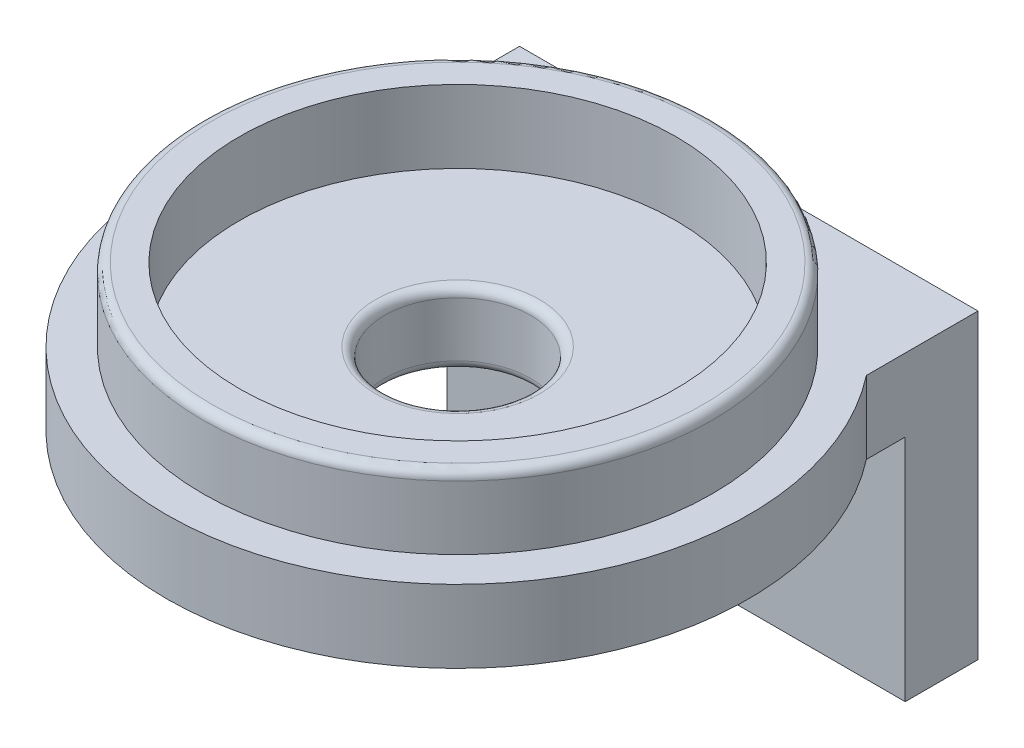
ISO-10303-21;
HEADER;
FILE_DESCRIPTION(('STEP AP214'),'2;1');
FILE_NAME('part.step','',(''),(''),'','','');
FILE_SCHEMA(('AUTOMOTIVE_DESIGN { 1 0 10303 214 1 1 1 1 }'));
ENDSEC;
DATA;
#1=APPLICATION_CONTEXT('core data for automotive mechanical design processes');
#2=APPLICATION_PROTOCOL_DEFINITION('international standard','automotive_design',2000,#1);
#3=PRODUCT_CONTEXT('',#1,'mechanical');
#4=PRODUCT('Part','Part','',(#3));
#5=PRODUCT_RELATED_PRODUCT_CATEGORY('part','',(#4));
#6=PRODUCT_DEFINITION_FORMATION('','',#4);
#7=PRODUCT_DEFINITION_CONTEXT('part definition',#1,'design');
#8=PRODUCT_DEFINITION('design','',#6,#7);
#9=PRODUCT_DEFINITION_SHAPE('','',#8);
#10=(LENGTH_UNIT() NAMED_UNIT(*) SI_UNIT(.MILLI.,.METRE.));
#11=(NAMED_UNIT(*) PLANE_ANGLE_UNIT() SI_UNIT($,.RADIAN.));
#12=(NAMED_UNIT(*) SI_UNIT($,.STERADIAN.) SOLID_ANGLE_UNIT());
#13=UNCERTAINTY_MEASURE_WITH_UNIT(LENGTH_MEASURE(1.E-05),#10,'distance_accuracy_value','');
#14=(GEOMETRIC_REPRESENTATION_CONTEXT(3) GLOBAL_UNCERTAINTY_ASSIGNED_CONTEXT((#13)) GLOBAL_UNIT_ASSIGNED_CONTEXT((#10,
#11,#12)) REPRESENTATION_CONTEXT('',''));
#15=CARTESIAN_POINT('',(0.,0.,0.));
#16=DIRECTION('',(0.,0.,1.));
#17=DIRECTION('',(1.,0.,0.));
#18=AXIS2_PLACEMENT_3D('',#15,#16,#17);
#19=CARTESIAN_POINT('',(0.,-32.3252119356495,0.));
#20=DIRECTION('',(0.,-1.,0.));
#21=DIRECTION('',(0.,0.,-1.));
#22=AXIS2_PLACEMENT_3D('',#19,#20,#21);
#23=CYLINDRICAL_SURFACE('',#22,25.4);
#24=CARTESIAN_POINT('',(0.,-3.175,0.));
#25=DIRECTION('',(0.,-1.,0.));
#26=DIRECTION('',(0.,0.,-1.));
#27=AXIS2_PLACEMENT_3D('',#24,#25,#26);
#28=CIRCLE('',#27,25.4);
#29=CARTESIAN_POINT('',(20.,-3.175,-15.6575860208399));
#30=VERTEX_POINT('',#29);
#31=CARTESIAN_POINT('',(-20.,-3.175,-15.6575860208399));
#32=VERTEX_POINT('',#31);
#33=EDGE_CURVE('E143',#30,#32,#28,.T.);
#34=ORIENTED_EDGE('',*,*,#33,.F.);
#35=DIRECTION('',(0.,-1.,0.));
#36=VECTOR('',#35,1.);
#37=CARTESIAN_POINT('',(20.,-32.3252119356495,-15.6575860208399));
#38=LINE('',#37,#36);
#39=CARTESIAN_POINT('',(20.,3.175,-15.6575860208399));
#40=VERTEX_POINT('',#39);
#41=EDGE_CURVE('E49',#30,#40,#38,.F.);
#42=ORIENTED_EDGE('',*,*,#41,.T.);
#43=CARTESIAN_POINT('',(0.,3.175,0.));
#44=DIRECTION('',(0.,-1.,0.));
#45=DIRECTION('',(0.,0.,-1.));
#46=AXIS2_PLACEMENT_3D('',#43,#44,#45);
#47=CIRCLE('',#46,25.4);
#48=CARTESIAN_POINT('',(-20.,3.175,-15.6575860208399));
#49=VERTEX_POINT('',#48);
#50=EDGE_CURVE('E106',#40,#49,#47,.T.);
#51=ORIENTED_EDGE('',*,*,#50,.T.);
#52=DIRECTION('',(0.,-1.,0.));
#53=VECTOR('',#52,1.);
#54=CARTESIAN_POINT('',(-20.,-32.3252119356495,-15.6575860208399));
#55=LINE('',#54,#53);
#56=EDGE_CURVE('E99',#32,#49,#55,.F.);
#57=ORIENTED_EDGE('',*,*,#56,.F.);
#58=EDGE_LOOP('',(#34,#42,#51,#57));
#59=FACE_BOUND('',#58,.T.);
#60=ADVANCED_FACE('F34',(#59),#23,.T.);
#61=CARTESIAN_POINT('',(0.,-3.175,-6.35));
#62=DIRECTION('',(0.,-1.,0.));
#63=DIRECTION('',(0.,0.,-1.));
#64=AXIS2_PLACEMENT_3D('',#61,#62,#63);
#65=PLANE('',#64);
#66=DIRECTION('',(1.,0.,0.));
#67=VECTOR('',#66,1.);
#68=CARTESIAN_POINT('',(0.,-3.175,-19.05));
#69=LINE('',#68,#67);
#70=CARTESIAN_POINT('',(-20.,-3.175,-19.05));
#71=VERTEX_POINT('',#70);
#72=CARTESIAN_POINT('',(20.,-3.175,-19.05));
#73=VERTEX_POINT('',#72);
#74=EDGE_CURVE('E11',#71,#73,#69,.T.);
#75=ORIENTED_EDGE('',*,*,#74,.T.);
#76=DIRECTION('',(0.,0.,-1.));
#77=VECTOR('',#76,1.);
#78=CARTESIAN_POINT('',(20.,-3.175,-19.05));
#79=LINE('',#78,#77);
#80=EDGE_CURVE('E107',#30,#73,#79,.T.);
#81=ORIENTED_EDGE('',*,*,#80,.F.);
#82=ORIENTED_EDGE('',*,*,#33,.T.);
#83=DIRECTION('',(0.,0.,-1.));
#84=VECTOR('',#83,1.);
#85=CARTESIAN_POINT('',(-20.,-3.175,-19.05));
#86=LINE('',#85,#84);
#87=EDGE_CURVE('E57',#32,#71,#86,.T.);
#88=ORIENTED_EDGE('',*,*,#87,.T.);
#89=EDGE_LOOP('',(#75,#81,#82,#88));
#90=FACE_BOUND('',#89,.T.);
#91=CARTESIAN_POINT('',(0.,-3.175,0.));
#92=DIRECTION('',(0.,-1.,0.));
#93=DIRECTION('',(0.,0.,-1.));
#94=AXIS2_PLACEMENT_3D('',#91,#92,#93);
#95=CIRCLE('',#94,7.14375);
#96=CARTESIAN_POINT('',(0.,-3.175,-7.14375));
#97=VERTEX_POINT('',#96);
#98=EDGE_CURVE('E156',#97,#97,#95,.F.);
#99=ORIENTED_EDGE('',*,*,#98,.T.);
#100=EDGE_LOOP('',(#99));
#101=FACE_BOUND('',#100,.T.);
#102=ADVANCED_FACE('F193',(#90,#101),#65,.T.);
#103=CARTESIAN_POINT('',(0.,9.525,-19.05));
#104=DIRECTION('',(0.,1.,0.));
#105=DIRECTION('',(0.,0.,1.));
#106=AXIS2_PLACEMENT_3D('',#103,#104,#105);
#107=PLANE('',#106);
#108=CARTESIAN_POINT('',(0.,9.525,0.));
#109=DIRECTION('',(0.,1.,0.));
#110=DIRECTION('',(0.,0.,1.));
#111=AXIS2_PLACEMENT_3D('',#108,#109,#110);
#112=CIRCLE('',#111,21.43125);
#113=CARTESIAN_POINT('',(0.,9.525,21.43125));
#114=VERTEX_POINT('',#113);
#115=EDGE_CURVE('E42',#114,#114,#112,.T.);
#116=ORIENTED_EDGE('',*,*,#115,.T.);
#117=EDGE_LOOP('',(#116));
#118=FACE_BOUND('',#117,.T.);
#119=CARTESIAN_POINT('',(0.,9.525,0.));
#120=DIRECTION('',(0.,-1.,0.));
#121=DIRECTION('',(0.,0.,-1.));
#122=AXIS2_PLACEMENT_3D('',#119,#120,#121);
#123=CIRCLE('',#122,19.05);
#124=CARTESIAN_POINT('',(0.,9.525,-19.05));
#125=VERTEX_POINT('',#124);
#126=EDGE_CURVE('E137',#125,#125,#123,.T.);
#127=ORIENTED_EDGE('',*,*,#126,.T.);
#128=EDGE_LOOP('',(#127));
#129=FACE_BOUND('',#128,.T.);
#130=ADVANCED_FACE('F167',(#118,#129),#107,.T.);
#131=CARTESIAN_POINT('',(0.,-32.3252119356495,0.));
#132=DIRECTION('',(0.,-1.,0.));
#133=DIRECTION('',(0.,0.,-1.));
#134=AXIS2_PLACEMENT_3D('',#131,#132,#133);
#135=CYLINDRICAL_SURFACE('',#134,22.225);
#136=CARTESIAN_POINT('',(0.,8.73125,0.));
#137=DIRECTION('',(0.,1.,0.));
#138=DIRECTION('',(0.,0.,1.));
#139=AXIS2_PLACEMENT_3D('',#136,#137,#138);
#140=CIRCLE('',#139,22.225);
#141=CARTESIAN_POINT('',(0.,8.73125,22.225));
#142=VERTEX_POINT('',#141);
#143=EDGE_CURVE('E162',#142,#142,#140,.F.);
#144=ORIENTED_EDGE('',*,*,#143,.T.);
#145=EDGE_LOOP('',(#144));
#146=FACE_BOUND('',#145,.T.);
#147=CARTESIAN_POINT('',(0.,3.175,0.));
#148=DIRECTION('',(0.,-1.,0.));
#149=DIRECTION('',(0.,0.,-1.));
#150=AXIS2_PLACEMENT_3D('',#147,#148,#149);
#151=CIRCLE('',#150,22.225);
#152=CARTESIAN_POINT('',(0.,3.175,-22.225));
#153=VERTEX_POINT('',#152);
#154=EDGE_CURVE('E147',#153,#153,#151,.T.);
#155=ORIENTED_EDGE('',*,*,#154,.F.);
#156=EDGE_LOOP('',(#155));
#157=FACE_BOUND('',#156,.T.);
#158=ADVANCED_FACE('F176',(#146,#157),#135,.T.);
#159=CARTESIAN_POINT('',(0.,3.175,-22.225));
#160=DIRECTION('',(0.,1.,0.));
#161=DIRECTION('',(0.,0.,1.));
#162=AXIS2_PLACEMENT_3D('',#159,#160,#161);
#163=PLANE('',#162);
#164=ORIENTED_EDGE('',*,*,#154,.T.);
#165=EDGE_LOOP('',(#164));
#166=FACE_BOUND('',#165,.T.);
#167=ORIENTED_EDGE('',*,*,#50,.F.);
#168=DIRECTION('',(0.,0.,1.));
#169=VECTOR('',#168,1.);
#170=CARTESIAN_POINT('',(20.,3.175,-25.4));
#171=LINE('',#170,#169);
#172=CARTESIAN_POINT('',(20.,3.175,-25.4));
#173=VERTEX_POINT('',#172);
#174=EDGE_CURVE('E103',#173,#40,#171,.T.);
#175=ORIENTED_EDGE('',*,*,#174,.F.);
#176=DIRECTION('',(-1.,0.,0.));
#177=VECTOR('',#176,1.);
#178=CARTESIAN_POINT('',(20.,3.175,-25.4));
#179=LINE('',#178,#177);
#180=CARTESIAN_POINT('',(-20.,3.175,-25.4));
#181=VERTEX_POINT('',#180);
#182=EDGE_CURVE('E87',#173,#181,#179,.T.);
#183=ORIENTED_EDGE('',*,*,#182,.T.);
#184=DIRECTION('',(0.,0.,1.));
#185=VECTOR('',#184,1.);
#186=CARTESIAN_POINT('',(-20.,3.175,-25.4));
#187=LINE('',#186,#185);
#188=EDGE_CURVE('E125',#181,#49,#187,.T.);
#189=ORIENTED_EDGE('',*,*,#188,.T.);
#190=EDGE_LOOP('',(#167,#175,#183,#189));
#191=FACE_BOUND('',#190,.T.);
#192=ADVANCED_FACE('F104',(#166,#191),#163,.T.);
#193=CARTESIAN_POINT('',(0.,-32.3252119356495,0.));
#194=DIRECTION('',(0.,-1.,0.));
#195=DIRECTION('',(0.,0.,-1.));
#196=AXIS2_PLACEMENT_3D('',#193,#194,#195);
#197=CYLINDRICAL_SURFACE('',#196,6.35);
#198=CARTESIAN_POINT('',(0.,-2.38125,0.));
#199=DIRECTION('',(0.,-1.,0.));
#200=DIRECTION('',(0.,0.,-1.));
#201=AXIS2_PLACEMENT_3D('',#198,#199,#200);
#202=CIRCLE('',#201,6.35);
#203=CARTESIAN_POINT('',(0.,-2.38125,-6.35));
#204=VERTEX_POINT('',#203);
#205=EDGE_CURVE('E153',#204,#204,#202,.T.);
#206=ORIENTED_EDGE('',*,*,#205,.T.);
#207=EDGE_LOOP('',(#206));
#208=FACE_BOUND('',#207,.T.);
#209=CARTESIAN_POINT('',(0.,2.38125,0.));
#210=DIRECTION('',(0.,1.,0.));
#211=DIRECTION('',(0.,0.,1.));
#212=AXIS2_PLACEMENT_3D('',#209,#210,#211);
#213=CIRCLE('',#212,6.35);
#214=CARTESIAN_POINT('',(0.,2.38125,6.35));
#215=VERTEX_POINT('',#214);
#216=EDGE_CURVE('E150',#215,#215,#213,.T.);
#217=ORIENTED_EDGE('',*,*,#216,.T.);
#218=EDGE_LOOP('',(#217));
#219=FACE_BOUND('',#218,.T.);
#220=ADVANCED_FACE('F183',(#208,#219),#197,.F.);
#221=CARTESIAN_POINT('',(0.,3.175,-19.05));
#222=DIRECTION('',(0.,1.,0.));
#223=DIRECTION('',(0.,0.,1.));
#224=AXIS2_PLACEMENT_3D('',#221,#222,#223);
#225=PLANE('',#224);
#226=CARTESIAN_POINT('',(0.,3.175,0.));
#227=DIRECTION('',(0.,-1.,0.));
#228=DIRECTION('',(0.,0.,-1.));
#229=AXIS2_PLACEMENT_3D('',#226,#227,#228);
#230=CIRCLE('',#229,19.05);
#231=CARTESIAN_POINT('',(0.,3.175,-19.05));
#232=VERTEX_POINT('',#231);
#233=EDGE_CURVE('E140',#232,#232,#230,.T.);
#234=ORIENTED_EDGE('',*,*,#233,.F.);
#235=EDGE_LOOP('',(#234));
#236=FACE_BOUND('',#235,.T.);
#237=CARTESIAN_POINT('',(0.,3.175,0.));
#238=DIRECTION('',(0.,1.,0.));
#239=DIRECTION('',(0.,0.,1.));
#240=AXIS2_PLACEMENT_3D('',#237,#238,#239);
#241=CIRCLE('',#240,7.14375);
#242=CARTESIAN_POINT('',(0.,3.175,7.14375));
#243=VERTEX_POINT('',#242);
#244=EDGE_CURVE('E159',#243,#243,#241,.F.);
#245=ORIENTED_EDGE('',*,*,#244,.T.);
#246=EDGE_LOOP('',(#245));
#247=FACE_BOUND('',#246,.T.);
#248=ADVANCED_FACE('F188',(#236,#247),#225,.T.);
#249=CARTESIAN_POINT('',(0.,-32.3252119356495,0.));
#250=DIRECTION('',(0.,-1.,0.));
#251=DIRECTION('',(0.,0.,-1.));
#252=AXIS2_PLACEMENT_3D('',#249,#250,#251);
#253=CYLINDRICAL_SURFACE('',#252,19.05);
#254=ORIENTED_EDGE('',*,*,#233,.T.);
#255=EDGE_LOOP('',(#254));
#256=FACE_BOUND('',#255,.T.);
#257=ORIENTED_EDGE('',*,*,#126,.F.);
#258=EDGE_LOOP('',(#257));
#259=FACE_BOUND('',#258,.T.);
#260=ADVANCED_FACE('F204',(#256,#259),#253,.F.);
#261=CARTESIAN_POINT('',(0.,-2.38125,0.));
#262=DIRECTION('',(0.,-1.,0.));
#263=DIRECTION('',(0.,0.,-1.));
#264=AXIS2_PLACEMENT_3D('',#261,#262,#263);
#265=TOROIDAL_SURFACE('',#264,7.14375,0.79375);
#266=ORIENTED_EDGE('',*,*,#98,.F.);
#267=EDGE_LOOP('',(#266));
#268=FACE_BOUND('',#267,.T.);
#269=ORIENTED_EDGE('',*,*,#205,.F.);
#270=EDGE_LOOP('',(#269));
#271=FACE_BOUND('',#270,.T.);
#272=ADVANCED_FACE('F208',(#268,#271),#265,.T.);
#273=CARTESIAN_POINT('',(0.,2.38125,0.));
#274=DIRECTION('',(0.,1.,0.));
#275=DIRECTION('',(0.,0.,1.));
#276=AXIS2_PLACEMENT_3D('',#273,#274,#275);
#277=TOROIDAL_SURFACE('',#276,7.14375,0.79375);
#278=ORIENTED_EDGE('',*,*,#216,.F.);
#279=EDGE_LOOP('',(#278));
#280=FACE_BOUND('',#279,.T.);
#281=ORIENTED_EDGE('',*,*,#244,.F.);
#282=EDGE_LOOP('',(#281));
#283=FACE_BOUND('',#282,.T.);
#284=ADVANCED_FACE('F173',(#280,#283),#277,.T.);
#285=CARTESIAN_POINT('',(0.,8.73125,0.));
#286=DIRECTION('',(0.,1.,0.));
#287=DIRECTION('',(0.,0.,1.));
#288=AXIS2_PLACEMENT_3D('',#285,#286,#287);
#289=TOROIDAL_SURFACE('',#288,21.43125,0.79375);
#290=ORIENTED_EDGE('',*,*,#115,.F.);
#291=EDGE_LOOP('',(#290));
#292=FACE_BOUND('',#291,.T.);
#293=ORIENTED_EDGE('',*,*,#143,.F.);
#294=EDGE_LOOP('',(#293));
#295=FACE_BOUND('',#294,.T.);
#296=ADVANCED_FACE('F36',(#292,#295),#289,.T.);
#297=CARTESIAN_POINT('',(20.,-3.175,-19.05));
#298=DIRECTION('',(0.,0.,-1.));
#299=DIRECTION('',(0.,1.,0.));
#300=AXIS2_PLACEMENT_3D('',#297,#298,#299);
#301=PLANE('',#300);
#302=CARTESIAN_POINT('',(-9.99999999999999,-13.175,-19.05));
#303=DIRECTION('',(0.,0.,1.));
#304=DIRECTION('',(1.,0.,0.));
#305=AXIS2_PLACEMENT_3D('',#302,#303,#304);
#306=CIRCLE('',#305,2.1);
#307=CARTESIAN_POINT('',(-7.89999999999999,-13.175,-19.05));
#308=VERTEX_POINT('',#307);
#309=EDGE_CURVE('E239',#308,#308,#306,.T.);
#310=ORIENTED_EDGE('',*,*,#309,.F.);
#311=EDGE_LOOP('',(#310));
#312=FACE_BOUND('',#311,.T.);
#313=CARTESIAN_POINT('',(10.,-13.175,-19.05));
#314=DIRECTION('',(0.,0.,1.));
#315=DIRECTION('',(1.,0.,0.));
#316=AXIS2_PLACEMENT_3D('',#313,#314,#315);
#317=CIRCLE('',#316,2.1);
#318=CARTESIAN_POINT('',(12.1,-13.175,-19.05));
#319=VERTEX_POINT('',#318);
#320=EDGE_CURVE('E117',#319,#319,#317,.T.);
#321=ORIENTED_EDGE('',*,*,#320,.F.);
#322=EDGE_LOOP('',(#321));
#323=FACE_BOUND('',#322,.T.);
#324=DIRECTION('',(0.,-1.,0.));
#325=VECTOR('',#324,1.);
#326=CARTESIAN_POINT('',(-20.,-3.175,-19.05));
#327=LINE('',#326,#325);
#328=CARTESIAN_POINT('',(-20.,-23.174999878,-19.05));
#329=VERTEX_POINT('',#328);
#330=EDGE_CURVE('E129',#71,#329,#327,.T.);
#331=ORIENTED_EDGE('',*,*,#330,.T.);
#332=DIRECTION('',(-1.,0.,0.));
#333=VECTOR('',#332,1.);
#334=CARTESIAN_POINT('',(20.,-23.174999878,-19.05));
#335=LINE('',#334,#333);
#336=CARTESIAN_POINT('',(20.,-23.174999878,-19.05));
#337=VERTEX_POINT('',#336);
#338=EDGE_CURVE('E100',#337,#329,#335,.T.);
#339=ORIENTED_EDGE('',*,*,#338,.F.);
#340=DIRECTION('',(0.,-1.,0.));
#341=VECTOR('',#340,1.);
#342=CARTESIAN_POINT('',(20.,-3.175,-19.05));
#343=LINE('',#342,#341);
#344=EDGE_CURVE('E121',#73,#337,#343,.T.);
#345=ORIENTED_EDGE('',*,*,#344,.F.);
#346=ORIENTED_EDGE('',*,*,#74,.F.);
#347=EDGE_LOOP('',(#331,#339,#345,#346));
#348=FACE_BOUND('',#347,.T.);
#349=ADVANCED_FACE('F172',(#312,#323,#348),#301,.F.);
#350=CARTESIAN_POINT('',(20.,-23.174999878,-25.4));
#351=DIRECTION('',(0.,1.,0.));
#352=DIRECTION('',(0.,0.,1.));
#353=AXIS2_PLACEMENT_3D('',#350,#351,#352);
#354=PLANE('',#353);
#355=DIRECTION('',(0.,0.,-1.));
#356=VECTOR('',#355,1.);
#357=CARTESIAN_POINT('',(-20.,-23.174999878,-25.4));
#358=LINE('',#357,#356);
#359=CARTESIAN_POINT('',(-20.,-23.174999878,-25.4));
#360=VERTEX_POINT('',#359);
#361=EDGE_CURVE('E114',#329,#360,#358,.T.);
#362=ORIENTED_EDGE('',*,*,#361,.T.);
#363=DIRECTION('',(-1.,0.,0.));
#364=VECTOR('',#363,1.);
#365=CARTESIAN_POINT('',(20.,-23.174999878,-25.4));
#366=LINE('',#365,#364);
#367=CARTESIAN_POINT('',(20.,-23.174999878,-25.4));
#368=VERTEX_POINT('',#367);
#369=EDGE_CURVE('E124',#368,#360,#366,.T.);
#370=ORIENTED_EDGE('',*,*,#369,.F.);
#371=DIRECTION('',(0.,0.,-1.));
#372=VECTOR('',#371,1.);
#373=CARTESIAN_POINT('',(20.,-23.174999878,-25.4));
#374=LINE('',#373,#372);
#375=EDGE_CURVE('E111',#337,#368,#374,.T.);
#376=ORIENTED_EDGE('',*,*,#375,.F.);
#377=ORIENTED_EDGE('',*,*,#338,.T.);
#378=EDGE_LOOP('',(#362,#370,#376,#377));
#379=FACE_BOUND('',#378,.T.);
#380=ADVANCED_FACE('F212',(#379),#354,.F.);
#381=CARTESIAN_POINT('',(20.,-3.175,-25.4));
#382=DIRECTION('',(0.,0.,1.));
#383=DIRECTION('',(1.,0.,0.));
#384=AXIS2_PLACEMENT_3D('',#381,#382,#383);
#385=PLANE('',#384);
#386=CARTESIAN_POINT('',(-9.99999999999999,-13.175,-25.4));
#387=DIRECTION('',(0.,0.,1.));
#388=DIRECTION('',(1.,0.,0.));
#389=AXIS2_PLACEMENT_3D('',#386,#387,#388);
#390=CIRCLE('',#389,2.1);
#391=CARTESIAN_POINT('',(-7.89999999999999,-13.175,-25.4));
#392=VERTEX_POINT('',#391);
#393=EDGE_CURVE('E127',#392,#392,#390,.T.);
#394=ORIENTED_EDGE('',*,*,#393,.T.);
#395=EDGE_LOOP('',(#394));
#396=FACE_BOUND('',#395,.T.);
#397=CARTESIAN_POINT('',(10.,-13.175,-25.4));
#398=DIRECTION('',(0.,0.,1.));
#399=DIRECTION('',(1.,0.,0.));
#400=AXIS2_PLACEMENT_3D('',#397,#398,#399);
#401=CIRCLE('',#400,2.1);
#402=CARTESIAN_POINT('',(12.1,-13.175,-25.4));
#403=VERTEX_POINT('',#402);
#404=EDGE_CURVE('E240',#403,#403,#401,.T.);
#405=ORIENTED_EDGE('',*,*,#404,.T.);
#406=EDGE_LOOP('',(#405));
#407=FACE_BOUND('',#406,.T.);
#408=ORIENTED_EDGE('',*,*,#182,.F.);
#409=DIRECTION('',(0.,1.,0.));
#410=VECTOR('',#409,1.);
#411=CARTESIAN_POINT('',(20.,3.175,-25.4));
#412=LINE('',#411,#410);
#413=EDGE_CURVE('E92',#368,#173,#412,.T.);
#414=ORIENTED_EDGE('',*,*,#413,.F.);
#415=ORIENTED_EDGE('',*,*,#369,.T.);
#416=DIRECTION('',(0.,1.,0.));
#417=VECTOR('',#416,1.);
#418=CARTESIAN_POINT('',(-20.,-3.175,-25.4));
#419=LINE('',#418,#417);
#420=EDGE_CURVE('E95',#360,#181,#419,.T.);
#421=ORIENTED_EDGE('',*,*,#420,.T.);
#422=EDGE_LOOP('',(#408,#414,#415,#421));
#423=FACE_BOUND('',#422,.T.);
#424=ADVANCED_FACE('F89',(#396,#407,#423),#385,.F.);
#425=CARTESIAN_POINT('',(20.,0.,0.));
#426=DIRECTION('',(-1.,0.,0.));
#427=DIRECTION('',(0.,0.,1.));
#428=AXIS2_PLACEMENT_3D('',#425,#426,#427);
#429=PLANE('',#428);
#430=ORIENTED_EDGE('',*,*,#41,.F.);
#431=ORIENTED_EDGE('',*,*,#80,.T.);
#432=ORIENTED_EDGE('',*,*,#344,.T.);
#433=ORIENTED_EDGE('',*,*,#375,.T.);
#434=ORIENTED_EDGE('',*,*,#413,.T.);
#435=ORIENTED_EDGE('',*,*,#174,.T.);
#436=EDGE_LOOP('',(#430,#431,#432,#433,#434,#435));
#437=FACE_BOUND('',#436,.T.);
#438=ADVANCED_FACE('F109',(#437),#429,.F.);
#439=CARTESIAN_POINT('',(-20.,0.,0.));
#440=DIRECTION('',(-1.,0.,0.));
#441=DIRECTION('',(0.,0.,1.));
#442=AXIS2_PLACEMENT_3D('',#439,#440,#441);
#443=PLANE('',#442);
#444=ORIENTED_EDGE('',*,*,#87,.F.);
#445=ORIENTED_EDGE('',*,*,#56,.T.);
#446=ORIENTED_EDGE('',*,*,#188,.F.);
#447=ORIENTED_EDGE('',*,*,#420,.F.);
#448=ORIENTED_EDGE('',*,*,#361,.F.);
#449=ORIENTED_EDGE('',*,*,#330,.F.);
#450=EDGE_LOOP('',(#444,#445,#446,#447,#448,#449));
#451=FACE_BOUND('',#450,.T.);
#452=ADVANCED_FACE('F220',(#451),#443,.T.);
#453=CARTESIAN_POINT('',(10.,-13.175,-25.4));
#454=DIRECTION('',(0.,0.,1.));
#455=DIRECTION('',(1.,0.,0.));
#456=AXIS2_PLACEMENT_3D('',#453,#454,#455);
#457=CYLINDRICAL_SURFACE('',#456,2.1);
#458=ORIENTED_EDGE('',*,*,#404,.F.);
#459=EDGE_LOOP('',(#458));
#460=FACE_BOUND('',#459,.T.);
#461=ORIENTED_EDGE('',*,*,#320,.T.);
#462=EDGE_LOOP('',(#461));
#463=FACE_BOUND('',#462,.T.);
#464=ADVANCED_FACE('F223',(#460,#463),#457,.F.);
#465=CARTESIAN_POINT('',(-9.99999999999999,-13.175,-25.4));
#466=DIRECTION('',(0.,0.,1.));
#467=DIRECTION('',(1.,0.,0.));
#468=AXIS2_PLACEMENT_3D('',#465,#466,#467);
#469=CYLINDRICAL_SURFACE('',#468,2.1);
#470=ORIENTED_EDGE('',*,*,#393,.F.);
#471=EDGE_LOOP('',(#470));
#472=FACE_BOUND('',#471,.T.);
#473=ORIENTED_EDGE('',*,*,#309,.T.);
#474=EDGE_LOOP('',(#473));
#475=FACE_BOUND('',#474,.T.);
#476=ADVANCED_FACE('F228',(#472,#475),#469,.F.);
#477=CLOSED_SHELL('',(#60,#102,#130,#158,#192,#220,#248,#260,#272,#284,#296,#349,#380,#424,#438,
#452,#464,#476));
#478=MANIFOLD_SOLID_BREP('B2',#477);
#479=ADVANCED_BREP_SHAPE_REPRESENTATION('',(#18,#478),#14);
#480=SHAPE_DEFINITION_REPRESENTATION(#9,#479);
ENDSEC;
END-ISO-10303-21;
